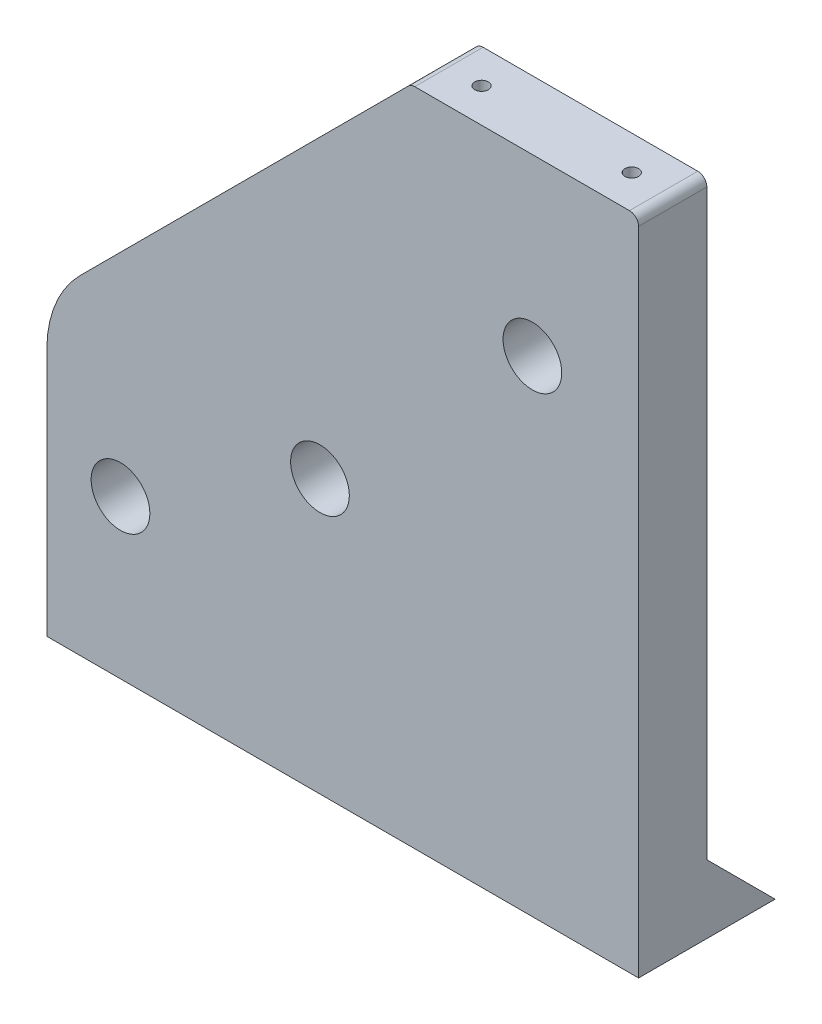
ISO-10303-21;
HEADER;
FILE_DESCRIPTION(('STEP AP214'),'2;1');
FILE_NAME('part.step','',(''),(''),'','','');
FILE_SCHEMA(('AUTOMOTIVE_DESIGN { 1 0 10303 214 1 1 1 1 }'));
ENDSEC;
DATA;
#1=APPLICATION_CONTEXT('core data for automotive mechanical design processes');
#2=APPLICATION_PROTOCOL_DEFINITION('international standard','automotive_design',2000,#1);
#3=PRODUCT_CONTEXT('',#1,'mechanical');
#4=PRODUCT('Part','Part','',(#3));
#5=PRODUCT_RELATED_PRODUCT_CATEGORY('part','',(#4));
#6=PRODUCT_DEFINITION_FORMATION('','',#4);
#7=PRODUCT_DEFINITION_CONTEXT('part definition',#1,'design');
#8=PRODUCT_DEFINITION('design','',#6,#7);
#9=PRODUCT_DEFINITION_SHAPE('','',#8);
#10=(LENGTH_UNIT() NAMED_UNIT(*) SI_UNIT(.MILLI.,.METRE.));
#11=(NAMED_UNIT(*) PLANE_ANGLE_UNIT() SI_UNIT($,.RADIAN.));
#12=(NAMED_UNIT(*) SI_UNIT($,.STERADIAN.) SOLID_ANGLE_UNIT());
#13=UNCERTAINTY_MEASURE_WITH_UNIT(LENGTH_MEASURE(1.E-05),#10,'distance_accuracy_value','');
#14=(GEOMETRIC_REPRESENTATION_CONTEXT(3) GLOBAL_UNCERTAINTY_ASSIGNED_CONTEXT((#13)) GLOBAL_UNIT_ASSIGNED_CONTEXT((#10,
#11,#12)) REPRESENTATION_CONTEXT('',''));
#15=CARTESIAN_POINT('',(0.,0.,0.));
#16=DIRECTION('',(0.,0.,1.));
#17=DIRECTION('',(1.,0.,0.));
#18=AXIS2_PLACEMENT_3D('',#15,#16,#17);
#19=CARTESIAN_POINT('',(0.,0.,15.));
#20=DIRECTION('',(0.,0.,-1.));
#21=DIRECTION('',(-1.,0.,0.));
#22=AXIS2_PLACEMENT_3D('',#19,#20,#21);
#23=PLANE('',#22);
#24=DIRECTION('',(-1.,0.,0.));
#25=VECTOR('',#24,1.);
#26=CARTESIAN_POINT('',(0.,145.,15.));
#27=LINE('',#26,#25);
#28=CARTESIAN_POINT('',(128.,145.,15.));
#29=VERTEX_POINT('',#28);
#30=CARTESIAN_POINT('',(80.8284271247464,145.,15.));
#31=VERTEX_POINT('',#30);
#32=EDGE_CURVE('E166',#29,#31,#27,.T.);
#33=ORIENTED_EDGE('',*,*,#32,.T.);
#34=CARTESIAN_POINT('',(80.8284271247464,143.,15.));
#35=DIRECTION('',(0.,0.,-1.));
#36=DIRECTION('',(-1.,0.,0.));
#37=AXIS2_PLACEMENT_3D('',#34,#35,#36);
#38=CIRCLE('',#37,2.);
#39=CARTESIAN_POINT('',(79.4142135623733,144.414213562373,15.));
#40=VERTEX_POINT('',#39);
#41=EDGE_CURVE('E195',#31,#40,#38,.F.);
#42=ORIENTED_EDGE('',*,*,#41,.T.);
#43=DIRECTION('',(0.707106781186549,0.707106781186546,0.));
#44=VECTOR('',#43,1.);
#45=CARTESIAN_POINT('',(0.,65.,15.));
#46=LINE('',#45,#44);
#47=CARTESIAN_POINT('',(7.32233047033634,72.3223304703363,15.));
#48=VERTEX_POINT('',#47);
#49=EDGE_CURVE('E176',#40,#48,#46,.F.);
#50=ORIENTED_EDGE('',*,*,#49,.T.);
#51=CARTESIAN_POINT('',(25.,54.6446609406726,15.));
#52=DIRECTION('',(0.,0.,-1.));
#53=DIRECTION('',(-1.,0.,0.));
#54=AXIS2_PLACEMENT_3D('',#51,#52,#53);
#55=CIRCLE('',#54,25.);
#56=CARTESIAN_POINT('',(0.,54.6446609406726,15.));
#57=VERTEX_POINT('',#56);
#58=EDGE_CURVE('E185',#48,#57,#55,.F.);
#59=ORIENTED_EDGE('',*,*,#58,.T.);
#60=DIRECTION('',(0.,-1.,0.));
#61=VECTOR('',#60,1.);
#62=CARTESIAN_POINT('',(0.,0.,15.));
#63=LINE('',#62,#61);
#64=CARTESIAN_POINT('',(0.,0.,15.));
#65=VERTEX_POINT('',#64);
#66=EDGE_CURVE('E159',#57,#65,#63,.T.);
#67=ORIENTED_EDGE('',*,*,#66,.T.);
#68=DIRECTION('',(1.,0.,0.));
#69=VECTOR('',#68,1.);
#70=CARTESIAN_POINT('',(0.,0.,15.));
#71=LINE('',#70,#69);
#72=CARTESIAN_POINT('',(130.,0.,15.));
#73=VERTEX_POINT('',#72);
#74=EDGE_CURVE('E117',#65,#73,#71,.T.);
#75=ORIENTED_EDGE('',*,*,#74,.T.);
#76=DIRECTION('',(0.,1.,0.));
#77=VECTOR('',#76,1.);
#78=CARTESIAN_POINT('',(130.,0.,15.));
#79=LINE('',#78,#77);
#80=CARTESIAN_POINT('',(130.,143.,15.));
#81=VERTEX_POINT('',#80);
#82=EDGE_CURVE('E163',#73,#81,#79,.T.);
#83=ORIENTED_EDGE('',*,*,#82,.T.);
#84=CARTESIAN_POINT('',(128.,143.,15.));
#85=DIRECTION('',(0.,0.,-1.));
#86=DIRECTION('',(-1.,0.,0.));
#87=AXIS2_PLACEMENT_3D('',#84,#85,#86);
#88=CIRCLE('',#87,2.);
#89=EDGE_CURVE('E193',#81,#29,#88,.F.);
#90=ORIENTED_EDGE('',*,*,#89,.T.);
#91=EDGE_LOOP('',(#33,#42,#50,#59,#67,#75,#83,#90));
#92=FACE_BOUND('',#91,.T.);
#93=CARTESIAN_POINT('',(60.,60.,15.));
#94=DIRECTION('',(0.,0.,1.));
#95=DIRECTION('',(1.,0.,0.));
#96=AXIS2_PLACEMENT_3D('',#93,#94,#95);
#97=CIRCLE('',#96,6.45);
#98=CARTESIAN_POINT('',(66.45,60.,15.));
#99=VERTEX_POINT('',#98);
#100=EDGE_CURVE('E154',#99,#99,#97,.T.);
#101=ORIENTED_EDGE('',*,*,#100,.F.);
#102=EDGE_LOOP('',(#101));
#103=FACE_BOUND('',#102,.T.);
#104=CARTESIAN_POINT('',(106.669047558312,106.669047558312,15.));
#105=DIRECTION('',(0.,0.,1.));
#106=DIRECTION('',(1.,0.,0.));
#107=AXIS2_PLACEMENT_3D('',#104,#105,#106);
#108=CIRCLE('',#107,6.45);
#109=CARTESIAN_POINT('',(113.119047558312,106.669047558312,15.));
#110=VERTEX_POINT('',#109);
#111=EDGE_CURVE('E148',#110,#110,#108,.T.);
#112=ORIENTED_EDGE('',*,*,#111,.F.);
#113=EDGE_LOOP('',(#112));
#114=FACE_BOUND('',#113,.T.);
#115=CARTESIAN_POINT('',(16.1791145685074,34.6999999999999,15.));
#116=DIRECTION('',(0.,0.,1.));
#117=DIRECTION('',(1.,0.,0.));
#118=AXIS2_PLACEMENT_3D('',#115,#116,#117);
#119=CIRCLE('',#118,6.45);
#120=CARTESIAN_POINT('',(22.6291145685074,34.6999999999999,15.));
#121=VERTEX_POINT('',#120);
#122=EDGE_CURVE('E142',#121,#121,#119,.T.);
#123=ORIENTED_EDGE('',*,*,#122,.F.);
#124=EDGE_LOOP('',(#123));
#125=FACE_BOUND('',#124,.T.);
#126=ADVANCED_FACE('F39',(#92,#103,#114,#125),#23,.F.);
#127=CARTESIAN_POINT('',(0.,0.,0.));
#128=DIRECTION('',(0.,0.,-1.));
#129=DIRECTION('',(-1.,0.,0.));
#130=AXIS2_PLACEMENT_3D('',#127,#128,#129);
#131=PLANE('',#130);
#132=DIRECTION('',(1.,0.,0.));
#133=VECTOR('',#132,1.);
#134=CARTESIAN_POINT('',(0.,15.,0.));
#135=LINE('',#134,#133);
#136=CARTESIAN_POINT('',(0.,15.,0.));
#137=VERTEX_POINT('',#136);
#138=CARTESIAN_POINT('',(130.,15.,0.));
#139=VERTEX_POINT('',#138);
#140=EDGE_CURVE('E54',#137,#139,#135,.T.);
#141=ORIENTED_EDGE('',*,*,#140,.F.);
#142=DIRECTION('',(0.,-1.,0.));
#143=VECTOR('',#142,1.);
#144=CARTESIAN_POINT('',(0.,0.,0.));
#145=LINE('',#144,#143);
#146=CARTESIAN_POINT('',(0.,54.6446609406726,0.));
#147=VERTEX_POINT('',#146);
#148=EDGE_CURVE('E132',#147,#137,#145,.T.);
#149=ORIENTED_EDGE('',*,*,#148,.F.);
#150=CARTESIAN_POINT('',(25.,54.6446609406726,0.));
#151=DIRECTION('',(0.,0.,-1.));
#152=DIRECTION('',(-1.,0.,0.));
#153=AXIS2_PLACEMENT_3D('',#150,#151,#152);
#154=CIRCLE('',#153,25.);
#155=CARTESIAN_POINT('',(7.32233047033634,72.3223304703363,0.));
#156=VERTEX_POINT('',#155);
#157=EDGE_CURVE('E180',#147,#156,#154,.T.);
#158=ORIENTED_EDGE('',*,*,#157,.T.);
#159=DIRECTION('',(-0.707106781186549,-0.707106781186546,0.));
#160=VECTOR('',#159,1.);
#161=CARTESIAN_POINT('',(-32.5,32.5000000000001,0.));
#162=LINE('',#161,#160);
#163=CARTESIAN_POINT('',(79.4142135623733,144.414213562373,0.));
#164=VERTEX_POINT('',#163);
#165=EDGE_CURVE('E121',#156,#164,#162,.F.);
#166=ORIENTED_EDGE('',*,*,#165,.T.);
#167=CARTESIAN_POINT('',(80.8284271247464,143.,0.));
#168=DIRECTION('',(0.,0.,-1.));
#169=DIRECTION('',(-1.,0.,0.));
#170=AXIS2_PLACEMENT_3D('',#167,#168,#169);
#171=CIRCLE('',#170,2.);
#172=CARTESIAN_POINT('',(80.8284271247464,145.,0.));
#173=VERTEX_POINT('',#172);
#174=EDGE_CURVE('E47',#164,#173,#171,.T.);
#175=ORIENTED_EDGE('',*,*,#174,.T.);
#176=DIRECTION('',(-1.,0.,0.));
#177=VECTOR('',#176,1.);
#178=CARTESIAN_POINT('',(0.,145.,0.));
#179=LINE('',#178,#177);
#180=CARTESIAN_POINT('',(128.,145.,0.));
#181=VERTEX_POINT('',#180);
#182=EDGE_CURVE('E161',#181,#173,#179,.T.);
#183=ORIENTED_EDGE('',*,*,#182,.F.);
#184=CARTESIAN_POINT('',(128.,143.,0.));
#185=DIRECTION('',(0.,0.,-1.));
#186=DIRECTION('',(-1.,0.,0.));
#187=AXIS2_PLACEMENT_3D('',#184,#185,#186);
#188=CIRCLE('',#187,2.);
#189=CARTESIAN_POINT('',(130.,143.,0.));
#190=VERTEX_POINT('',#189);
#191=EDGE_CURVE('E199',#181,#190,#188,.T.);
#192=ORIENTED_EDGE('',*,*,#191,.T.);
#193=DIRECTION('',(0.,1.,0.));
#194=VECTOR('',#193,1.);
#195=CARTESIAN_POINT('',(130.,0.,0.));
#196=LINE('',#195,#194);
#197=EDGE_CURVE('E60',#139,#190,#196,.T.);
#198=ORIENTED_EDGE('',*,*,#197,.F.);
#199=EDGE_LOOP('',(#141,#149,#158,#166,#175,#183,#192,#198));
#200=FACE_BOUND('',#199,.T.);
#201=CARTESIAN_POINT('',(106.669047558312,106.669047558312,0.));
#202=DIRECTION('',(0.,0.,1.));
#203=DIRECTION('',(1.,0.,0.));
#204=AXIS2_PLACEMENT_3D('',#201,#202,#203);
#205=CIRCLE('',#204,6.45);
#206=CARTESIAN_POINT('',(113.119047558312,106.669047558312,0.));
#207=VERTEX_POINT('',#206);
#208=EDGE_CURVE('E145',#207,#207,#205,.T.);
#209=ORIENTED_EDGE('',*,*,#208,.T.);
#210=EDGE_LOOP('',(#209));
#211=FACE_BOUND('',#210,.T.);
#212=CARTESIAN_POINT('',(60.,60.,0.));
#213=DIRECTION('',(0.,0.,1.));
#214=DIRECTION('',(1.,0.,0.));
#215=AXIS2_PLACEMENT_3D('',#212,#213,#214);
#216=CIRCLE('',#215,6.45);
#217=CARTESIAN_POINT('',(66.45,60.,0.));
#218=VERTEX_POINT('',#217);
#219=EDGE_CURVE('E151',#218,#218,#216,.T.);
#220=ORIENTED_EDGE('',*,*,#219,.T.);
#221=EDGE_LOOP('',(#220));
#222=FACE_BOUND('',#221,.T.);
#223=CARTESIAN_POINT('',(16.1791145685074,34.6999999999999,0.));
#224=DIRECTION('',(0.,0.,1.));
#225=DIRECTION('',(1.,0.,0.));
#226=AXIS2_PLACEMENT_3D('',#223,#224,#225);
#227=CIRCLE('',#226,6.45);
#228=CARTESIAN_POINT('',(22.6291145685074,34.6999999999999,0.));
#229=VERTEX_POINT('',#228);
#230=EDGE_CURVE('E140',#229,#229,#227,.T.);
#231=ORIENTED_EDGE('',*,*,#230,.T.);
#232=EDGE_LOOP('',(#231));
#233=FACE_BOUND('',#232,.T.);
#234=ADVANCED_FACE('F202',(#200,#211,#222,#233),#131,.T.);
#235=CARTESIAN_POINT('',(0.,0.,15.));
#236=DIRECTION('',(1.,0.,0.));
#237=DIRECTION('',(0.,0.,-1.));
#238=AXIS2_PLACEMENT_3D('',#235,#236,#237);
#239=PLANE('',#238);
#240=ORIENTED_EDGE('',*,*,#66,.F.);
#241=DIRECTION('',(0.,0.,1.));
#242=VECTOR('',#241,1.);
#243=CARTESIAN_POINT('',(0.,54.6446609406726,0.));
#244=LINE('',#243,#242);
#245=EDGE_CURVE('E178',#57,#147,#244,.F.);
#246=ORIENTED_EDGE('',*,*,#245,.T.);
#247=ORIENTED_EDGE('',*,*,#148,.T.);
#248=DIRECTION('',(0.,0.707106781186547,0.707106781186547));
#249=VECTOR('',#248,1.);
#250=CARTESIAN_POINT('',(0.,15.,0.));
#251=LINE('',#250,#249);
#252=CARTESIAN_POINT('',(0.,0.,-15.));
#253=VERTEX_POINT('',#252);
#254=EDGE_CURVE('E127',#253,#137,#251,.T.);
#255=ORIENTED_EDGE('',*,*,#254,.F.);
#256=DIRECTION('',(0.,0.,-1.));
#257=VECTOR('',#256,1.);
#258=CARTESIAN_POINT('',(0.,0.,15.));
#259=LINE('',#258,#257);
#260=EDGE_CURVE('E111',#65,#253,#259,.T.);
#261=ORIENTED_EDGE('',*,*,#260,.F.);
#262=EDGE_LOOP('',(#240,#246,#247,#255,#261));
#263=FACE_BOUND('',#262,.T.);
#264=ADVANCED_FACE('F130',(#263),#239,.F.);
#265=CARTESIAN_POINT('',(0.,0.,15.));
#266=DIRECTION('',(0.,1.,0.));
#267=DIRECTION('',(0.,0.,1.));
#268=AXIS2_PLACEMENT_3D('',#265,#266,#267);
#269=PLANE('',#268);
#270=CARTESIAN_POINT('',(35.,0.,7.5));
#271=DIRECTION('',(0.,-1.,0.));
#272=DIRECTION('',(0.,0.,-1.));
#273=AXIS2_PLACEMENT_3D('',#270,#271,#272);
#274=CIRCLE('',#273,2.75);
#275=CARTESIAN_POINT('',(35.,0.,4.75));
#276=VERTEX_POINT('',#275);
#277=EDGE_CURVE('E513',#276,#276,#274,.T.);
#278=ORIENTED_EDGE('',*,*,#277,.F.);
#279=EDGE_LOOP('',(#278));
#280=FACE_BOUND('',#279,.T.);
#281=CARTESIAN_POINT('',(105.,0.,7.5));
#282=DIRECTION('',(0.,-1.,0.));
#283=DIRECTION('',(0.,0.,-1.));
#284=AXIS2_PLACEMENT_3D('',#281,#282,#283);
#285=CIRCLE('',#284,2.75000000000001);
#286=CARTESIAN_POINT('',(105.,0.,4.74999999999999));
#287=VERTEX_POINT('',#286);
#288=EDGE_CURVE('E501',#287,#287,#285,.T.);
#289=ORIENTED_EDGE('',*,*,#288,.F.);
#290=EDGE_LOOP('',(#289));
#291=FACE_BOUND('',#290,.T.);
#292=ORIENTED_EDGE('',*,*,#260,.T.);
#293=DIRECTION('',(1.,0.,0.));
#294=VECTOR('',#293,1.);
#295=CARTESIAN_POINT('',(0.,0.,-15.));
#296=LINE('',#295,#294);
#297=CARTESIAN_POINT('',(130.,0.,-15.));
#298=VERTEX_POINT('',#297);
#299=EDGE_CURVE('E115',#253,#298,#296,.T.);
#300=ORIENTED_EDGE('',*,*,#299,.T.);
#301=DIRECTION('',(0.,0.,-1.));
#302=VECTOR('',#301,1.);
#303=CARTESIAN_POINT('',(130.,0.,15.));
#304=LINE('',#303,#302);
#305=EDGE_CURVE('E122',#73,#298,#304,.T.);
#306=ORIENTED_EDGE('',*,*,#305,.F.);
#307=ORIENTED_EDGE('',*,*,#74,.F.);
#308=EDGE_LOOP('',(#292,#300,#306,#307));
#309=FACE_BOUND('',#308,.T.);
#310=ADVANCED_FACE('F113',(#280,#291,#309),#269,.F.);
#311=CARTESIAN_POINT('',(130.,0.,15.));
#312=DIRECTION('',(-1.,0.,0.));
#313=DIRECTION('',(0.,0.,1.));
#314=AXIS2_PLACEMENT_3D('',#311,#312,#313);
#315=PLANE('',#314);
#316=ORIENTED_EDGE('',*,*,#305,.T.);
#317=DIRECTION('',(0.,0.707106781186547,0.707106781186547));
#318=VECTOR('',#317,1.);
#319=CARTESIAN_POINT('',(130.,15.,0.));
#320=LINE('',#319,#318);
#321=EDGE_CURVE('E128',#298,#139,#320,.T.);
#322=ORIENTED_EDGE('',*,*,#321,.T.);
#323=ORIENTED_EDGE('',*,*,#197,.T.);
#324=DIRECTION('',(0.,0.,-1.));
#325=VECTOR('',#324,1.);
#326=CARTESIAN_POINT('',(130.,143.,15.));
#327=LINE('',#326,#325);
#328=EDGE_CURVE('E11',#190,#81,#327,.F.);
#329=ORIENTED_EDGE('',*,*,#328,.T.);
#330=ORIENTED_EDGE('',*,*,#82,.F.);
#331=EDGE_LOOP('',(#316,#322,#323,#329,#330));
#332=FACE_BOUND('',#331,.T.);
#333=ADVANCED_FACE('F225',(#332),#315,.F.);
#334=CARTESIAN_POINT('',(0.,145.,15.));
#335=DIRECTION('',(0.,-1.,0.));
#336=DIRECTION('',(0.,0.,-1.));
#337=AXIS2_PLACEMENT_3D('',#334,#335,#336);
#338=PLANE('',#337);
#339=CARTESIAN_POINT('',(121.,145.,7.5));
#340=DIRECTION('',(0.,1.,0.));
#341=DIRECTION('',(0.,0.,1.));
#342=AXIS2_PLACEMENT_3D('',#339,#340,#341);
#343=CIRCLE('',#342,1.5);
#344=CARTESIAN_POINT('',(121.,145.,9.));
#345=VERTEX_POINT('',#344);
#346=EDGE_CURVE('E498',#345,#345,#343,.T.);
#347=ORIENTED_EDGE('',*,*,#346,.F.);
#348=EDGE_LOOP('',(#347));
#349=FACE_BOUND('',#348,.T.);
#350=CARTESIAN_POINT('',(88.,145.,7.5));
#351=DIRECTION('',(0.,1.,0.));
#352=DIRECTION('',(0.,0.,1.));
#353=AXIS2_PLACEMENT_3D('',#350,#351,#352);
#354=CIRCLE('',#353,1.5);
#355=CARTESIAN_POINT('',(88.,145.,9.));
#356=VERTEX_POINT('',#355);
#357=EDGE_CURVE('E503',#356,#356,#354,.T.);
#358=ORIENTED_EDGE('',*,*,#357,.F.);
#359=EDGE_LOOP('',(#358));
#360=FACE_BOUND('',#359,.T.);
#361=ORIENTED_EDGE('',*,*,#182,.T.);
#362=DIRECTION('',(0.,0.,-1.));
#363=VECTOR('',#362,1.);
#364=CARTESIAN_POINT('',(80.8284271247464,145.,15.));
#365=LINE('',#364,#363);
#366=EDGE_CURVE('E190',#173,#31,#365,.F.);
#367=ORIENTED_EDGE('',*,*,#366,.T.);
#368=ORIENTED_EDGE('',*,*,#32,.F.);
#369=DIRECTION('',(0.,0.,-1.));
#370=VECTOR('',#369,1.);
#371=CARTESIAN_POINT('',(128.,145.,15.));
#372=LINE('',#371,#370);
#373=EDGE_CURVE('E187',#29,#181,#372,.T.);
#374=ORIENTED_EDGE('',*,*,#373,.T.);
#375=EDGE_LOOP('',(#361,#367,#368,#374));
#376=FACE_BOUND('',#375,.T.);
#377=ADVANCED_FACE('F209',(#349,#360,#376),#338,.F.);
#378=CARTESIAN_POINT('',(60.,60.,15.));
#379=DIRECTION('',(0.,0.,-1.));
#380=DIRECTION('',(-1.,0.,0.));
#381=AXIS2_PLACEMENT_3D('',#378,#379,#380);
#382=CYLINDRICAL_SURFACE('',#381,6.45);
#383=ORIENTED_EDGE('',*,*,#100,.T.);
#384=EDGE_LOOP('',(#383));
#385=FACE_BOUND('',#384,.T.);
#386=ORIENTED_EDGE('',*,*,#219,.F.);
#387=EDGE_LOOP('',(#386));
#388=FACE_BOUND('',#387,.T.);
#389=ADVANCED_FACE('F242',(#385,#388),#382,.F.);
#390=CARTESIAN_POINT('',(106.669047558312,106.669047558312,15.));
#391=DIRECTION('',(0.,0.,-1.));
#392=DIRECTION('',(-1.,0.,0.));
#393=AXIS2_PLACEMENT_3D('',#390,#391,#392);
#394=CYLINDRICAL_SURFACE('',#393,6.45);
#395=ORIENTED_EDGE('',*,*,#111,.T.);
#396=EDGE_LOOP('',(#395));
#397=FACE_BOUND('',#396,.T.);
#398=ORIENTED_EDGE('',*,*,#208,.F.);
#399=EDGE_LOOP('',(#398));
#400=FACE_BOUND('',#399,.T.);
#401=ADVANCED_FACE('F439',(#397,#400),#394,.F.);
#402=CARTESIAN_POINT('',(16.1791145685074,34.6999999999999,15.));
#403=DIRECTION('',(0.,0.,-1.));
#404=DIRECTION('',(-1.,0.,0.));
#405=AXIS2_PLACEMENT_3D('',#402,#403,#404);
#406=CYLINDRICAL_SURFACE('',#405,6.45);
#407=ORIENTED_EDGE('',*,*,#122,.T.);
#408=EDGE_LOOP('',(#407));
#409=FACE_BOUND('',#408,.T.);
#410=ORIENTED_EDGE('',*,*,#230,.F.);
#411=EDGE_LOOP('',(#410));
#412=FACE_BOUND('',#411,.T.);
#413=ADVANCED_FACE('F260',(#409,#412),#406,.F.);
#414=CARTESIAN_POINT('',(0.,65.,15.));
#415=DIRECTION('',(0.707106781186546,-0.707106781186549,0.));
#416=DIRECTION('',(0.,0.,-1.));
#417=AXIS2_PLACEMENT_3D('',#414,#415,#416);
#418=PLANE('',#417);
#419=ORIENTED_EDGE('',*,*,#49,.F.);
#420=DIRECTION('',(0.,0.,1.));
#421=VECTOR('',#420,1.);
#422=CARTESIAN_POINT('',(79.4142135623733,144.414213562373,0.));
#423=LINE('',#422,#421);
#424=EDGE_CURVE('E197',#40,#164,#423,.F.);
#425=ORIENTED_EDGE('',*,*,#424,.T.);
#426=ORIENTED_EDGE('',*,*,#165,.F.);
#427=DIRECTION('',(0.,0.,-1.));
#428=VECTOR('',#427,1.);
#429=CARTESIAN_POINT('',(7.32233047033633,72.3223304703363,15.));
#430=LINE('',#429,#428);
#431=EDGE_CURVE('E182',#156,#48,#430,.F.);
#432=ORIENTED_EDGE('',*,*,#431,.T.);
#433=EDGE_LOOP('',(#419,#425,#426,#432));
#434=FACE_BOUND('',#433,.T.);
#435=ADVANCED_FACE('F217',(#434),#418,.F.);
#436=CARTESIAN_POINT('',(25.,54.6446609406726,15.));
#437=DIRECTION('',(0.,0.,-1.));
#438=DIRECTION('',(-1.,0.,0.));
#439=AXIS2_PLACEMENT_3D('',#436,#437,#438);
#440=CYLINDRICAL_SURFACE('',#439,25.);
#441=ORIENTED_EDGE('',*,*,#58,.F.);
#442=ORIENTED_EDGE('',*,*,#431,.F.);
#443=ORIENTED_EDGE('',*,*,#157,.F.);
#444=ORIENTED_EDGE('',*,*,#245,.F.);
#445=EDGE_LOOP('',(#441,#442,#443,#444));
#446=FACE_BOUND('',#445,.T.);
#447=ADVANCED_FACE('F222',(#446),#440,.T.);
#448=CARTESIAN_POINT('',(80.8284271247464,143.,15.));
#449=DIRECTION('',(0.,0.,1.));
#450=DIRECTION('',(1.,0.,0.));
#451=AXIS2_PLACEMENT_3D('',#448,#449,#450);
#452=CYLINDRICAL_SURFACE('',#451,2.);
#453=ORIENTED_EDGE('',*,*,#174,.F.);
#454=ORIENTED_EDGE('',*,*,#424,.F.);
#455=ORIENTED_EDGE('',*,*,#41,.F.);
#456=ORIENTED_EDGE('',*,*,#366,.F.);
#457=EDGE_LOOP('',(#453,#454,#455,#456));
#458=FACE_BOUND('',#457,.T.);
#459=ADVANCED_FACE('F212',(#458),#452,.T.);
#460=CARTESIAN_POINT('',(128.,143.,15.));
#461=DIRECTION('',(0.,0.,-1.));
#462=DIRECTION('',(-1.,0.,0.));
#463=AXIS2_PLACEMENT_3D('',#460,#461,#462);
#464=CYLINDRICAL_SURFACE('',#463,2.);
#465=ORIENTED_EDGE('',*,*,#89,.F.);
#466=ORIENTED_EDGE('',*,*,#328,.F.);
#467=ORIENTED_EDGE('',*,*,#191,.F.);
#468=ORIENTED_EDGE('',*,*,#373,.F.);
#469=EDGE_LOOP('',(#465,#466,#467,#468));
#470=FACE_BOUND('',#469,.T.);
#471=ADVANCED_FACE('F41',(#470),#464,.T.);
#472=CARTESIAN_POINT('',(0.,15.,0.));
#473=DIRECTION('',(0.,0.707106781186547,-0.707106781186547));
#474=DIRECTION('',(0.,0.707106781186548,0.707106781186548));
#475=AXIS2_PLACEMENT_3D('',#472,#473,#474);
#476=PLANE('',#475);
#477=ORIENTED_EDGE('',*,*,#321,.F.);
#478=ORIENTED_EDGE('',*,*,#299,.F.);
#479=ORIENTED_EDGE('',*,*,#254,.T.);
#480=ORIENTED_EDGE('',*,*,#140,.T.);
#481=EDGE_LOOP('',(#477,#478,#479,#480));
#482=FACE_BOUND('',#481,.T.);
#483=ADVANCED_FACE('F126',(#482),#476,.T.);
#484=CARTESIAN_POINT('',(105.,45.,7.5));
#485=DIRECTION('',(0.,-1.,0.));
#486=DIRECTION('',(0.,0.,-1.));
#487=AXIS2_PLACEMENT_3D('',#484,#485,#486);
#488=CYLINDRICAL_SURFACE('',#487,2.75000000000001);
#489=CARTESIAN_POINT('',(105.,45.,7.5));
#490=DIRECTION('',(0.,-1.,0.));
#491=DIRECTION('',(0.,0.,-1.));
#492=AXIS2_PLACEMENT_3D('',#489,#490,#491);
#493=CIRCLE('',#492,2.75000000000001);
#494=CARTESIAN_POINT('',(105.,45.,4.74999999999999));
#495=VERTEX_POINT('',#494);
#496=EDGE_CURVE('E137',#495,#495,#493,.T.);
#497=ORIENTED_EDGE('',*,*,#496,.F.);
#498=EDGE_LOOP('',(#497));
#499=FACE_BOUND('',#498,.T.);
#500=ORIENTED_EDGE('',*,*,#288,.T.);
#501=EDGE_LOOP('',(#500));
#502=FACE_BOUND('',#501,.T.);
#503=ADVANCED_FACE('F233',(#499,#502),#488,.F.);
#504=CARTESIAN_POINT('',(105.,45.,7.5));
#505=DIRECTION('',(0.,-1.,0.));
#506=DIRECTION('',(0.,0.,-1.));
#507=AXIS2_PLACEMENT_3D('',#504,#505,#506);
#508=PLANE('',#507);
#509=ORIENTED_EDGE('',*,*,#496,.T.);
#510=EDGE_LOOP('',(#509));
#511=FACE_BOUND('',#510,.T.);
#512=ADVANCED_FACE('F325',(#511),#508,.T.);
#513=CARTESIAN_POINT('',(35.,45.,7.5));
#514=DIRECTION('',(0.,-1.,0.));
#515=DIRECTION('',(0.,0.,-1.));
#516=AXIS2_PLACEMENT_3D('',#513,#514,#515);
#517=CYLINDRICAL_SURFACE('',#516,2.75);
#518=CARTESIAN_POINT('',(35.,45.,7.5));
#519=DIRECTION('',(0.,-1.,0.));
#520=DIRECTION('',(0.,0.,-1.));
#521=AXIS2_PLACEMENT_3D('',#518,#519,#520);
#522=CIRCLE('',#521,2.75);
#523=CARTESIAN_POINT('',(35.,45.,4.75));
#524=VERTEX_POINT('',#523);
#525=EDGE_CURVE('E134',#524,#524,#522,.T.);
#526=ORIENTED_EDGE('',*,*,#525,.F.);
#527=EDGE_LOOP('',(#526));
#528=FACE_BOUND('',#527,.T.);
#529=ORIENTED_EDGE('',*,*,#277,.T.);
#530=EDGE_LOOP('',(#529));
#531=FACE_BOUND('',#530,.T.);
#532=ADVANCED_FACE('F336',(#528,#531),#517,.F.);
#533=CARTESIAN_POINT('',(35.,45.,7.5));
#534=DIRECTION('',(0.,-1.,0.));
#535=DIRECTION('',(0.,0.,-1.));
#536=AXIS2_PLACEMENT_3D('',#533,#534,#535);
#537=PLANE('',#536);
#538=ORIENTED_EDGE('',*,*,#525,.T.);
#539=EDGE_LOOP('',(#538));
#540=FACE_BOUND('',#539,.T.);
#541=ADVANCED_FACE('F347',(#540),#537,.T.);
#542=CARTESIAN_POINT('',(88.,120.,7.5));
#543=DIRECTION('',(0.,1.,0.));
#544=DIRECTION('',(0.,0.,1.));
#545=AXIS2_PLACEMENT_3D('',#542,#543,#544);
#546=CYLINDRICAL_SURFACE('',#545,1.5);
#547=CARTESIAN_POINT('',(88.,120.,7.5));
#548=DIRECTION('',(0.,1.,0.));
#549=DIRECTION('',(0.,0.,1.));
#550=AXIS2_PLACEMENT_3D('',#547,#548,#549);
#551=CIRCLE('',#550,1.5);
#552=CARTESIAN_POINT('',(88.,120.,9.));
#553=VERTEX_POINT('',#552);
#554=EDGE_CURVE('E508',#553,#553,#551,.T.);
#555=ORIENTED_EDGE('',*,*,#554,.F.);
#556=EDGE_LOOP('',(#555));
#557=FACE_BOUND('',#556,.T.);
#558=ORIENTED_EDGE('',*,*,#357,.T.);
#559=EDGE_LOOP('',(#558));
#560=FACE_BOUND('',#559,.T.);
#561=ADVANCED_FACE('F358',(#557,#560),#546,.F.);
#562=CARTESIAN_POINT('',(88.,120.,7.5));
#563=DIRECTION('',(0.,1.,0.));
#564=DIRECTION('',(0.,0.,1.));
#565=AXIS2_PLACEMENT_3D('',#562,#563,#564);
#566=PLANE('',#565);
#567=ORIENTED_EDGE('',*,*,#554,.T.);
#568=EDGE_LOOP('',(#567));
#569=FACE_BOUND('',#568,.T.);
#570=ADVANCED_FACE('F378',(#569),#566,.T.);
#571=CARTESIAN_POINT('',(121.,120.,7.5));
#572=DIRECTION('',(0.,1.,0.));
#573=DIRECTION('',(0.,0.,1.));
#574=AXIS2_PLACEMENT_3D('',#571,#572,#573);
#575=CYLINDRICAL_SURFACE('',#574,1.5);
#576=CARTESIAN_POINT('',(121.,120.,7.5));
#577=DIRECTION('',(0.,1.,0.));
#578=DIRECTION('',(0.,0.,1.));
#579=AXIS2_PLACEMENT_3D('',#576,#577,#578);
#580=CIRCLE('',#579,1.5);
#581=CARTESIAN_POINT('',(121.,120.,9.));
#582=VERTEX_POINT('',#581);
#583=EDGE_CURVE('E497',#582,#582,#580,.T.);
#584=ORIENTED_EDGE('',*,*,#583,.F.);
#585=EDGE_LOOP('',(#584));
#586=FACE_BOUND('',#585,.T.);
#587=ORIENTED_EDGE('',*,*,#346,.T.);
#588=EDGE_LOOP('',(#587));
#589=FACE_BOUND('',#588,.T.);
#590=ADVANCED_FACE('F389',(#586,#589),#575,.F.);
#591=CARTESIAN_POINT('',(121.,120.,7.5));
#592=DIRECTION('',(0.,1.,0.));
#593=DIRECTION('',(0.,0.,1.));
#594=AXIS2_PLACEMENT_3D('',#591,#592,#593);
#595=PLANE('',#594);
#596=ORIENTED_EDGE('',*,*,#583,.T.);
#597=EDGE_LOOP('',(#596));
#598=FACE_BOUND('',#597,.T.);
#599=ADVANCED_FACE('F400',(#598),#595,.T.);
#600=CLOSED_SHELL('',(#126,#234,#264,#310,#333,#377,#389,#401,#413,#435,#447,#459,#471,#483,
#503,#512,#532,#541,#561,#570,#590,#599));
#601=MANIFOLD_SOLID_BREP('B2',#600);
#602=ADVANCED_BREP_SHAPE_REPRESENTATION('',(#18,#601),#14);
#603=SHAPE_DEFINITION_REPRESENTATION(#9,#602);
ENDSEC;
END-ISO-10303-21;
